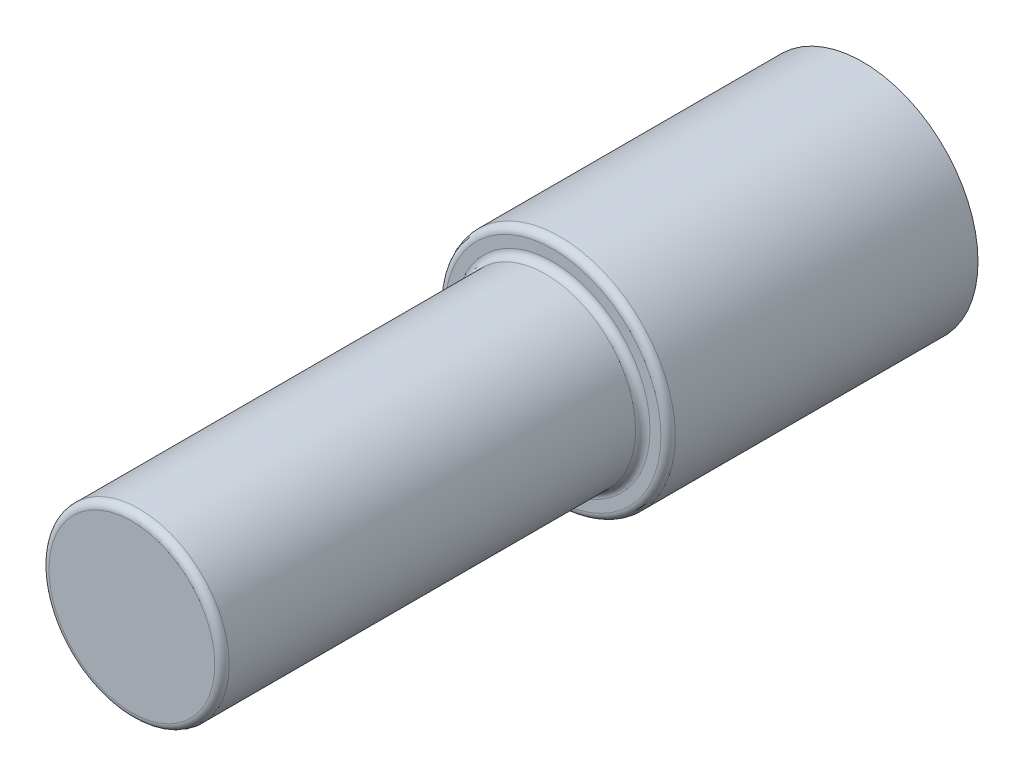
ISO-10303-21;
HEADER;
FILE_DESCRIPTION(('STEP AP214'),'2;1');
FILE_NAME('part.step','',(''),(''),'','','');
FILE_SCHEMA(('AUTOMOTIVE_DESIGN { 1 0 10303 214 1 1 1 1 }'));
ENDSEC;
DATA;
#1=APPLICATION_CONTEXT('core data for automotive mechanical design processes');
#2=APPLICATION_PROTOCOL_DEFINITION('international standard','automotive_design',2000,#1);
#3=PRODUCT_CONTEXT('',#1,'mechanical');
#4=PRODUCT('Part','Part','',(#3));
#5=PRODUCT_RELATED_PRODUCT_CATEGORY('part','',(#4));
#6=PRODUCT_DEFINITION_FORMATION('','',#4);
#7=PRODUCT_DEFINITION_CONTEXT('part definition',#1,'design');
#8=PRODUCT_DEFINITION('design','',#6,#7);
#9=PRODUCT_DEFINITION_SHAPE('','',#8);
#10=(LENGTH_UNIT() NAMED_UNIT(*) SI_UNIT(.MILLI.,.METRE.));
#11=(NAMED_UNIT(*) PLANE_ANGLE_UNIT() SI_UNIT($,.RADIAN.));
#12=(NAMED_UNIT(*) SI_UNIT($,.STERADIAN.) SOLID_ANGLE_UNIT());
#13=UNCERTAINTY_MEASURE_WITH_UNIT(LENGTH_MEASURE(1.E-05),#10,'distance_accuracy_value','');
#14=(GEOMETRIC_REPRESENTATION_CONTEXT(3) GLOBAL_UNCERTAINTY_ASSIGNED_CONTEXT((#13)) GLOBAL_UNIT_ASSIGNED_CONTEXT((#10,
#11,#12)) REPRESENTATION_CONTEXT('',''));
#15=CARTESIAN_POINT('',(0.,0.,0.));
#16=DIRECTION('',(0.,0.,1.));
#17=DIRECTION('',(1.,0.,0.));
#18=AXIS2_PLACEMENT_3D('',#15,#16,#17);
#19=CARTESIAN_POINT('',(0.,0.,-2.25));
#20=DIRECTION('',(0.,0.,-1.));
#21=DIRECTION('',(-1.,0.,0.));
#22=AXIS2_PLACEMENT_3D('',#19,#20,#21);
#23=PLANE('',#22);
#24=CARTESIAN_POINT('',(0.,0.,-2.25));
#25=DIRECTION('',(0.,0.,-1.));
#26=DIRECTION('',(-1.,0.,0.));
#27=AXIS2_PLACEMENT_3D('',#24,#25,#26);
#28=CIRCLE('',#27,9.5);
#29=CARTESIAN_POINT('',(-9.5,0.,-2.25));
#30=VERTEX_POINT('',#29);
#31=EDGE_CURVE('E97',#30,#30,#28,.T.);
#32=ORIENTED_EDGE('',*,*,#31,.T.);
#33=EDGE_LOOP('',(#32));
#34=FACE_BOUND('',#33,.T.);
#35=CARTESIAN_POINT('',(0.,0.,-2.25));
#36=DIRECTION('',(0.,0.,-1.));
#37=DIRECTION('',(-1.,0.,0.));
#38=AXIS2_PLACEMENT_3D('',#35,#36,#37);
#39=CIRCLE('',#38,5.);
#40=CARTESIAN_POINT('',(-5.,0.,-2.25));
#41=VERTEX_POINT('',#40);
#42=EDGE_CURVE('E91',#41,#41,#39,.T.);
#43=ORIENTED_EDGE('',*,*,#42,.F.);
#44=EDGE_LOOP('',(#43));
#45=FACE_BOUND('',#44,.T.);
#46=ADVANCED_FACE('F33',(#34,#45),#23,.T.);
#47=CARTESIAN_POINT('',(0.,0.,0.));
#48=DIRECTION('',(0.,0.,1.));
#49=DIRECTION('',(1.,0.,0.));
#50=AXIS2_PLACEMENT_3D('',#47,#48,#49);
#51=PLANE('',#50);
#52=CARTESIAN_POINT('',(0.,13.,0.));
#53=DIRECTION('',(0.,0.,-1.));
#54=DIRECTION('',(-1.,0.,0.));
#55=AXIS2_PLACEMENT_3D('',#52,#53,#54);
#56=CIRCLE('',#55,1.24999999999999);
#57=CARTESIAN_POINT('',(-1.24999999999999,13.,0.));
#58=VERTEX_POINT('',#57);
#59=EDGE_CURVE('E65',#58,#58,#56,.T.);
#60=ORIENTED_EDGE('',*,*,#59,.F.);
#61=EDGE_LOOP('',(#60));
#62=FACE_BOUND('',#61,.T.);
#63=CARTESIAN_POINT('',(13.,0.,0.));
#64=DIRECTION('',(0.,0.,-1.));
#65=DIRECTION('',(-1.,0.,0.));
#66=AXIS2_PLACEMENT_3D('',#63,#64,#65);
#67=CIRCLE('',#66,1.24999999999999);
#68=CARTESIAN_POINT('',(11.75,0.,0.));
#69=VERTEX_POINT('',#68);
#70=EDGE_CURVE('E64',#69,#69,#67,.T.);
#71=ORIENTED_EDGE('',*,*,#70,.F.);
#72=EDGE_LOOP('',(#71));
#73=FACE_BOUND('',#72,.T.);
#74=CARTESIAN_POINT('',(0.,-13.,0.));
#75=DIRECTION('',(0.,0.,-1.));
#76=DIRECTION('',(-1.,0.,0.));
#77=AXIS2_PLACEMENT_3D('',#74,#75,#76);
#78=CIRCLE('',#77,1.24999999999999);
#79=CARTESIAN_POINT('',(-1.24999999999999,-13.,0.));
#80=VERTEX_POINT('',#79);
#81=EDGE_CURVE('E75',#80,#80,#78,.T.);
#82=ORIENTED_EDGE('',*,*,#81,.F.);
#83=EDGE_LOOP('',(#82));
#84=FACE_BOUND('',#83,.T.);
#85=CARTESIAN_POINT('',(-13.,0.,0.));
#86=DIRECTION('',(0.,0.,-1.));
#87=DIRECTION('',(-1.,0.,0.));
#88=AXIS2_PLACEMENT_3D('',#85,#86,#87);
#89=CIRCLE('',#88,1.24999999999999);
#90=CARTESIAN_POINT('',(-14.25,0.,0.));
#91=VERTEX_POINT('',#90);
#92=EDGE_CURVE('E81',#91,#91,#89,.T.);
#93=ORIENTED_EDGE('',*,*,#92,.F.);
#94=EDGE_LOOP('',(#93));
#95=FACE_BOUND('',#94,.T.);
#96=CARTESIAN_POINT('',(0.,0.,0.));
#97=DIRECTION('',(0.,0.,1.));
#98=DIRECTION('',(1.,0.,0.));
#99=AXIS2_PLACEMENT_3D('',#96,#97,#98);
#100=CIRCLE('',#99,16.);
#101=CARTESIAN_POINT('',(16.,0.,0.));
#102=VERTEX_POINT('',#101);
#103=EDGE_CURVE('E102',#102,#102,#100,.T.);
#104=ORIENTED_EDGE('',*,*,#103,.F.);
#105=EDGE_LOOP('',(#104));
#106=FACE_BOUND('',#105,.T.);
#107=CARTESIAN_POINT('',(0.,0.,0.));
#108=DIRECTION('',(0.,0.,1.));
#109=DIRECTION('',(1.,0.,0.));
#110=AXIS2_PLACEMENT_3D('',#107,#108,#109);
#111=CIRCLE('',#110,9.5);
#112=CARTESIAN_POINT('',(9.5,0.,0.));
#113=VERTEX_POINT('',#112);
#114=EDGE_CURVE('E105',#113,#113,#111,.F.);
#115=ORIENTED_EDGE('',*,*,#114,.F.);
#116=EDGE_LOOP('',(#115));
#117=FACE_BOUND('',#116,.T.);
#118=ADVANCED_FACE('F133',(#62,#73,#84,#95,#106,#117),#51,.F.);
#119=CARTESIAN_POINT('',(0.,0.,43.));
#120=DIRECTION('',(0.,0.,1.));
#121=DIRECTION('',(1.,0.,0.));
#122=AXIS2_PLACEMENT_3D('',#119,#120,#121);
#123=PLANE('',#122);
#124=CARTESIAN_POINT('',(0.,0.,43.));
#125=DIRECTION('',(0.,0.,1.));
#126=DIRECTION('',(1.,0.,0.));
#127=AXIS2_PLACEMENT_3D('',#124,#125,#126);
#128=CIRCLE('',#127,13.5);
#129=CARTESIAN_POINT('',(13.5,0.,43.));
#130=VERTEX_POINT('',#129);
#131=EDGE_CURVE('E117',#130,#130,#128,.F.);
#132=ORIENTED_EDGE('',*,*,#131,.T.);
#133=EDGE_LOOP('',(#132));
#134=FACE_BOUND('',#133,.T.);
#135=CARTESIAN_POINT('',(0.,0.,43.));
#136=DIRECTION('',(0.,0.,1.));
#137=DIRECTION('',(1.,0.,0.));
#138=AXIS2_PLACEMENT_3D('',#135,#136,#137);
#139=CIRCLE('',#138,15.);
#140=CARTESIAN_POINT('',(15.,0.,43.));
#141=VERTEX_POINT('',#140);
#142=EDGE_CURVE('E114',#141,#141,#139,.T.);
#143=ORIENTED_EDGE('',*,*,#142,.T.);
#144=EDGE_LOOP('',(#143));
#145=FACE_BOUND('',#144,.T.);
#146=ADVANCED_FACE('F131',(#134,#145),#123,.T.);
#147=CARTESIAN_POINT('',(0.,0.,43.));
#148=DIRECTION('',(0.,0.,-1.));
#149=DIRECTION('',(-1.,0.,0.));
#150=AXIS2_PLACEMENT_3D('',#147,#148,#149);
#151=CYLINDRICAL_SURFACE('',#150,16.);
#152=CARTESIAN_POINT('',(0.,0.,42.));
#153=DIRECTION('',(0.,0.,1.));
#154=DIRECTION('',(1.,0.,0.));
#155=AXIS2_PLACEMENT_3D('',#152,#153,#154);
#156=CIRCLE('',#155,16.);
#157=CARTESIAN_POINT('',(16.,0.,42.));
#158=VERTEX_POINT('',#157);
#159=EDGE_CURVE('E41',#158,#158,#156,.F.);
#160=ORIENTED_EDGE('',*,*,#159,.T.);
#161=EDGE_LOOP('',(#160));
#162=FACE_BOUND('',#161,.T.);
#163=ORIENTED_EDGE('',*,*,#103,.T.);
#164=EDGE_LOOP('',(#163));
#165=FACE_BOUND('',#164,.T.);
#166=ADVANCED_FACE('F122',(#162,#165),#151,.T.);
#167=CARTESIAN_POINT('',(0.,0.,101.4));
#168=DIRECTION('',(0.,0.,-1.));
#169=DIRECTION('',(-1.,0.,0.));
#170=AXIS2_PLACEMENT_3D('',#167,#168,#169);
#171=CYLINDRICAL_SURFACE('',#170,12.5);
#172=CARTESIAN_POINT('',(0.,0.,44.));
#173=DIRECTION('',(0.,0.,1.));
#174=DIRECTION('',(1.,0.,0.));
#175=AXIS2_PLACEMENT_3D('',#172,#173,#174);
#176=CIRCLE('',#175,12.5);
#177=CARTESIAN_POINT('',(12.5,0.,44.));
#178=VERTEX_POINT('',#177);
#179=EDGE_CURVE('E111',#178,#178,#176,.T.);
#180=ORIENTED_EDGE('',*,*,#179,.T.);
#181=EDGE_LOOP('',(#180));
#182=FACE_BOUND('',#181,.T.);
#183=CARTESIAN_POINT('',(0.,0.,100.4));
#184=DIRECTION('',(0.,0.,1.));
#185=DIRECTION('',(1.,0.,0.));
#186=AXIS2_PLACEMENT_3D('',#183,#184,#185);
#187=CIRCLE('',#186,12.5);
#188=CARTESIAN_POINT('',(12.5,0.,100.4));
#189=VERTEX_POINT('',#188);
#190=EDGE_CURVE('E108',#189,#189,#187,.F.);
#191=ORIENTED_EDGE('',*,*,#190,.T.);
#192=EDGE_LOOP('',(#191));
#193=FACE_BOUND('',#192,.T.);
#194=ADVANCED_FACE('F140',(#182,#193),#171,.T.);
#195=CARTESIAN_POINT('',(0.,0.,101.4));
#196=DIRECTION('',(0.,0.,1.));
#197=DIRECTION('',(1.,0.,0.));
#198=AXIS2_PLACEMENT_3D('',#195,#196,#197);
#199=PLANE('',#198);
#200=CARTESIAN_POINT('',(0.,0.,101.4));
#201=DIRECTION('',(0.,0.,1.));
#202=DIRECTION('',(1.,0.,0.));
#203=AXIS2_PLACEMENT_3D('',#200,#201,#202);
#204=CIRCLE('',#203,11.5);
#205=CARTESIAN_POINT('',(11.5,0.,101.4));
#206=VERTEX_POINT('',#205);
#207=EDGE_CURVE('E11',#206,#206,#204,.T.);
#208=ORIENTED_EDGE('',*,*,#207,.T.);
#209=EDGE_LOOP('',(#208));
#210=FACE_BOUND('',#209,.T.);
#211=ADVANCED_FACE('F158',(#210),#199,.T.);
#212=CARTESIAN_POINT('',(0.,0.,-2.25));
#213=DIRECTION('',(0.,0.,1.));
#214=DIRECTION('',(1.,0.,0.));
#215=AXIS2_PLACEMENT_3D('',#212,#213,#214);
#216=CYLINDRICAL_SURFACE('',#215,9.5);
#217=ORIENTED_EDGE('',*,*,#31,.F.);
#218=EDGE_LOOP('',(#217));
#219=FACE_BOUND('',#218,.T.);
#220=ORIENTED_EDGE('',*,*,#114,.T.);
#221=EDGE_LOOP('',(#220));
#222=FACE_BOUND('',#221,.T.);
#223=ADVANCED_FACE('F155',(#219,#222),#216,.T.);
#224=CARTESIAN_POINT('',(0.,0.,-4.85));
#225=DIRECTION('',(0.,0.,1.));
#226=DIRECTION('',(1.,0.,0.));
#227=AXIS2_PLACEMENT_3D('',#224,#225,#226);
#228=CYLINDRICAL_SURFACE('',#227,5.);
#229=CARTESIAN_POINT('',(0.,0.,-4.85));
#230=DIRECTION('',(0.,0.,-1.));
#231=DIRECTION('',(-1.,0.,0.));
#232=AXIS2_PLACEMENT_3D('',#229,#230,#231);
#233=CIRCLE('',#232,5.);
#234=CARTESIAN_POINT('',(-5.,0.,-4.85));
#235=VERTEX_POINT('',#234);
#236=EDGE_CURVE('E94',#235,#235,#233,.T.);
#237=ORIENTED_EDGE('',*,*,#236,.F.);
#238=EDGE_LOOP('',(#237));
#239=FACE_BOUND('',#238,.T.);
#240=ORIENTED_EDGE('',*,*,#42,.T.);
#241=EDGE_LOOP('',(#240));
#242=FACE_BOUND('',#241,.T.);
#243=ADVANCED_FACE('F153',(#239,#242),#228,.T.);
#244=CARTESIAN_POINT('',(0.,0.,-4.85));
#245=DIRECTION('',(0.,0.,-1.));
#246=DIRECTION('',(-1.,0.,0.));
#247=AXIS2_PLACEMENT_3D('',#244,#245,#246);
#248=PLANE('',#247);
#249=CARTESIAN_POINT('',(0.,0.,-4.85));
#250=DIRECTION('',(0.,0.,-1.));
#251=DIRECTION('',(-1.,0.,0.));
#252=AXIS2_PLACEMENT_3D('',#249,#250,#251);
#253=CIRCLE('',#252,3.);
#254=CARTESIAN_POINT('',(-3.,0.,-4.85));
#255=VERTEX_POINT('',#254);
#256=EDGE_CURVE('E87',#255,#255,#253,.T.);
#257=ORIENTED_EDGE('',*,*,#256,.F.);
#258=EDGE_LOOP('',(#257));
#259=FACE_BOUND('',#258,.T.);
#260=ORIENTED_EDGE('',*,*,#236,.T.);
#261=EDGE_LOOP('',(#260));
#262=FACE_BOUND('',#261,.T.);
#263=ADVANCED_FACE('F194',(#259,#262),#248,.T.);
#264=CARTESIAN_POINT('',(0.,0.,0.150000000000001));
#265=DIRECTION('',(0.,0.,-1.));
#266=DIRECTION('',(-1.,0.,0.));
#267=AXIS2_PLACEMENT_3D('',#264,#265,#266);
#268=CYLINDRICAL_SURFACE('',#267,3.);
#269=CARTESIAN_POINT('',(0.,0.,0.150000000000001));
#270=DIRECTION('',(0.,0.,-1.));
#271=DIRECTION('',(-1.,0.,0.));
#272=AXIS2_PLACEMENT_3D('',#269,#270,#271);
#273=CIRCLE('',#272,3.);
#274=CARTESIAN_POINT('',(-3.,0.,0.150000000000001));
#275=VERTEX_POINT('',#274);
#276=EDGE_CURVE('E88',#275,#275,#273,.T.);
#277=ORIENTED_EDGE('',*,*,#276,.F.);
#278=EDGE_LOOP('',(#277));
#279=FACE_BOUND('',#278,.T.);
#280=ORIENTED_EDGE('',*,*,#256,.T.);
#281=EDGE_LOOP('',(#280));
#282=FACE_BOUND('',#281,.T.);
#283=ADVANCED_FACE('F191',(#279,#282),#268,.F.);
#284=CARTESIAN_POINT('',(0.,0.,0.150000000000001));
#285=DIRECTION('',(0.,0.,-1.));
#286=DIRECTION('',(-1.,0.,0.));
#287=AXIS2_PLACEMENT_3D('',#284,#285,#286);
#288=PLANE('',#287);
#289=ORIENTED_EDGE('',*,*,#276,.T.);
#290=EDGE_LOOP('',(#289));
#291=FACE_BOUND('',#290,.T.);
#292=ADVANCED_FACE('F188',(#291),#288,.T.);
#293=CARTESIAN_POINT('',(0.,0.,44.));
#294=DIRECTION('',(0.,0.,1.));
#295=DIRECTION('',(1.,0.,0.));
#296=AXIS2_PLACEMENT_3D('',#293,#294,#295);
#297=TOROIDAL_SURFACE('',#296,13.5,1.);
#298=ORIENTED_EDGE('',*,*,#131,.F.);
#299=EDGE_LOOP('',(#298));
#300=FACE_BOUND('',#299,.T.);
#301=ORIENTED_EDGE('',*,*,#179,.F.);
#302=EDGE_LOOP('',(#301));
#303=FACE_BOUND('',#302,.T.);
#304=ADVANCED_FACE('F128',(#300,#303),#297,.F.);
#305=CARTESIAN_POINT('',(0.,0.,42.));
#306=DIRECTION('',(0.,0.,1.));
#307=DIRECTION('',(1.,0.,0.));
#308=AXIS2_PLACEMENT_3D('',#305,#306,#307);
#309=TOROIDAL_SURFACE('',#308,15.,1.);
#310=ORIENTED_EDGE('',*,*,#159,.F.);
#311=EDGE_LOOP('',(#310));
#312=FACE_BOUND('',#311,.T.);
#313=ORIENTED_EDGE('',*,*,#142,.F.);
#314=EDGE_LOOP('',(#313));
#315=FACE_BOUND('',#314,.T.);
#316=ADVANCED_FACE('F125',(#312,#315),#309,.T.);
#317=CARTESIAN_POINT('',(0.,0.,100.4));
#318=DIRECTION('',(0.,0.,1.));
#319=DIRECTION('',(1.,0.,0.));
#320=AXIS2_PLACEMENT_3D('',#317,#318,#319);
#321=TOROIDAL_SURFACE('',#320,11.5,1.);
#322=ORIENTED_EDGE('',*,*,#190,.F.);
#323=EDGE_LOOP('',(#322));
#324=FACE_BOUND('',#323,.T.);
#325=ORIENTED_EDGE('',*,*,#207,.F.);
#326=EDGE_LOOP('',(#325));
#327=FACE_BOUND('',#326,.T.);
#328=ADVANCED_FACE('F35',(#324,#327),#321,.T.);
#329=CARTESIAN_POINT('',(-13.,0.,6.3));
#330=DIRECTION('',(0.,0.,-1.));
#331=DIRECTION('',(-1.,0.,0.));
#332=AXIS2_PLACEMENT_3D('',#329,#330,#331);
#333=CONICAL_SURFACE('',#332,1.25,1.02974425867665);
#334=CARTESIAN_POINT('',(-13.,0.,7.05107577378445));
#335=VERTEX_POINT('',#334);
#336=VERTEX_LOOP('',#335);
#337=FACE_BOUND('',#336,.T.);
#338=CARTESIAN_POINT('',(-13.,0.,6.3));
#339=DIRECTION('',(0.,0.,-1.));
#340=DIRECTION('',(-1.,0.,0.));
#341=AXIS2_PLACEMENT_3D('',#338,#339,#340);
#342=CIRCLE('',#341,1.25);
#343=CARTESIAN_POINT('',(-14.25,0.,6.3));
#344=VERTEX_POINT('',#343);
#345=EDGE_CURVE('E84',#344,#344,#342,.T.);
#346=ORIENTED_EDGE('',*,*,#345,.T.);
#347=EDGE_LOOP('',(#346));
#348=FACE_BOUND('',#347,.T.);
#349=ADVANCED_FACE('F172',(#337,#348),#333,.F.);
#350=CARTESIAN_POINT('',(-13.,0.,0.));
#351=DIRECTION('',(0.,0.,-1.));
#352=DIRECTION('',(-1.,0.,0.));
#353=AXIS2_PLACEMENT_3D('',#350,#351,#352);
#354=CYLINDRICAL_SURFACE('',#353,1.24999999999999);
#355=ORIENTED_EDGE('',*,*,#345,.F.);
#356=EDGE_LOOP('',(#355));
#357=FACE_BOUND('',#356,.T.);
#358=ORIENTED_EDGE('',*,*,#92,.T.);
#359=EDGE_LOOP('',(#358));
#360=FACE_BOUND('',#359,.T.);
#361=ADVANCED_FACE('F177',(#357,#360),#354,.F.);
#362=CARTESIAN_POINT('',(0.,-13.,6.3));
#363=DIRECTION('',(0.,0.,-1.));
#364=DIRECTION('',(-1.,0.,0.));
#365=AXIS2_PLACEMENT_3D('',#362,#363,#364);
#366=CONICAL_SURFACE('',#365,1.25,1.02974425867665);
#367=CARTESIAN_POINT('',(0.,-13.,7.05107577378445));
#368=VERTEX_POINT('',#367);
#369=VERTEX_LOOP('',#368);
#370=FACE_BOUND('',#369,.T.);
#371=CARTESIAN_POINT('',(0.,-13.,6.3));
#372=DIRECTION('',(0.,0.,-1.));
#373=DIRECTION('',(-1.,0.,0.));
#374=AXIS2_PLACEMENT_3D('',#371,#372,#373);
#375=CIRCLE('',#374,1.25);
#376=CARTESIAN_POINT('',(-1.25,-13.,6.3));
#377=VERTEX_POINT('',#376);
#378=EDGE_CURVE('E78',#377,#377,#375,.T.);
#379=ORIENTED_EDGE('',*,*,#378,.T.);
#380=EDGE_LOOP('',(#379));
#381=FACE_BOUND('',#380,.T.);
#382=ADVANCED_FACE('F182',(#370,#381),#366,.F.);
#383=CARTESIAN_POINT('',(0.,-13.,0.));
#384=DIRECTION('',(0.,0.,-1.));
#385=DIRECTION('',(-1.,0.,0.));
#386=AXIS2_PLACEMENT_3D('',#383,#384,#385);
#387=CYLINDRICAL_SURFACE('',#386,1.24999999999999);
#388=ORIENTED_EDGE('',*,*,#378,.F.);
#389=EDGE_LOOP('',(#388));
#390=FACE_BOUND('',#389,.T.);
#391=ORIENTED_EDGE('',*,*,#81,.T.);
#392=EDGE_LOOP('',(#391));
#393=FACE_BOUND('',#392,.T.);
#394=ADVANCED_FACE('F268',(#390,#393),#387,.F.);
#395=CARTESIAN_POINT('',(13.,0.,6.3));
#396=DIRECTION('',(0.,0.,-1.));
#397=DIRECTION('',(-1.,0.,0.));
#398=AXIS2_PLACEMENT_3D('',#395,#396,#397);
#399=CONICAL_SURFACE('',#398,1.25,1.02974425867665);
#400=CARTESIAN_POINT('',(13.,0.,7.05107577378445));
#401=VERTEX_POINT('',#400);
#402=VERTEX_LOOP('',#401);
#403=FACE_BOUND('',#402,.T.);
#404=CARTESIAN_POINT('',(13.,0.,6.3));
#405=DIRECTION('',(0.,0.,-1.));
#406=DIRECTION('',(-1.,0.,0.));
#407=AXIS2_PLACEMENT_3D('',#404,#405,#406);
#408=CIRCLE('',#407,1.25);
#409=CARTESIAN_POINT('',(11.75,0.,6.3));
#410=VERTEX_POINT('',#409);
#411=EDGE_CURVE('E68',#410,#410,#408,.T.);
#412=ORIENTED_EDGE('',*,*,#411,.T.);
#413=EDGE_LOOP('',(#412));
#414=FACE_BOUND('',#413,.T.);
#415=ADVANCED_FACE('F276',(#403,#414),#399,.F.);
#416=CARTESIAN_POINT('',(13.,0.,0.));
#417=DIRECTION('',(0.,0.,-1.));
#418=DIRECTION('',(-1.,0.,0.));
#419=AXIS2_PLACEMENT_3D('',#416,#417,#418);
#420=CYLINDRICAL_SURFACE('',#419,1.24999999999999);
#421=ORIENTED_EDGE('',*,*,#411,.F.);
#422=EDGE_LOOP('',(#421));
#423=FACE_BOUND('',#422,.T.);
#424=ORIENTED_EDGE('',*,*,#70,.T.);
#425=EDGE_LOOP('',(#424));
#426=FACE_BOUND('',#425,.T.);
#427=ADVANCED_FACE('F58',(#423,#426),#420,.F.);
#428=CARTESIAN_POINT('',(0.,13.,6.3));
#429=DIRECTION('',(0.,0.,-1.));
#430=DIRECTION('',(-1.,0.,0.));
#431=AXIS2_PLACEMENT_3D('',#428,#429,#430);
#432=CONICAL_SURFACE('',#431,1.25,1.02974425867665);
#433=CARTESIAN_POINT('',(0.,13.,7.05107577378445));
#434=VERTEX_POINT('',#433);
#435=VERTEX_LOOP('',#434);
#436=FACE_BOUND('',#435,.T.);
#437=CARTESIAN_POINT('',(0.,13.,6.3));
#438=DIRECTION('',(0.,0.,-1.));
#439=DIRECTION('',(-1.,0.,0.));
#440=AXIS2_PLACEMENT_3D('',#437,#438,#439);
#441=CIRCLE('',#440,1.25);
#442=CARTESIAN_POINT('',(-1.25,13.,6.3));
#443=VERTEX_POINT('',#442);
#444=EDGE_CURVE('E62',#443,#443,#441,.T.);
#445=ORIENTED_EDGE('',*,*,#444,.T.);
#446=EDGE_LOOP('',(#445));
#447=FACE_BOUND('',#446,.T.);
#448=ADVANCED_FACE('F54',(#436,#447),#432,.F.);
#449=CARTESIAN_POINT('',(0.,13.,0.));
#450=DIRECTION('',(0.,0.,-1.));
#451=DIRECTION('',(-1.,0.,0.));
#452=AXIS2_PLACEMENT_3D('',#449,#450,#451);
#453=CYLINDRICAL_SURFACE('',#452,1.24999999999999);
#454=ORIENTED_EDGE('',*,*,#444,.F.);
#455=EDGE_LOOP('',(#454));
#456=FACE_BOUND('',#455,.T.);
#457=ORIENTED_EDGE('',*,*,#59,.T.);
#458=EDGE_LOOP('',(#457));
#459=FACE_BOUND('',#458,.T.);
#460=ADVANCED_FACE('F57',(#456,#459),#453,.F.);
#461=CLOSED_SHELL('',(#46,#118,#146,#166,#194,#211,#223,#243,#263,#283,#292,#304,#316,#328,#349,
#361,#382,#394,#415,#427,#448,#460));
#462=MANIFOLD_SOLID_BREP('B2',#461);
#463=ADVANCED_BREP_SHAPE_REPRESENTATION('',(#18,#462),#14);
#464=SHAPE_DEFINITION_REPRESENTATION(#9,#463);
ENDSEC;
END-ISO-10303-21;
